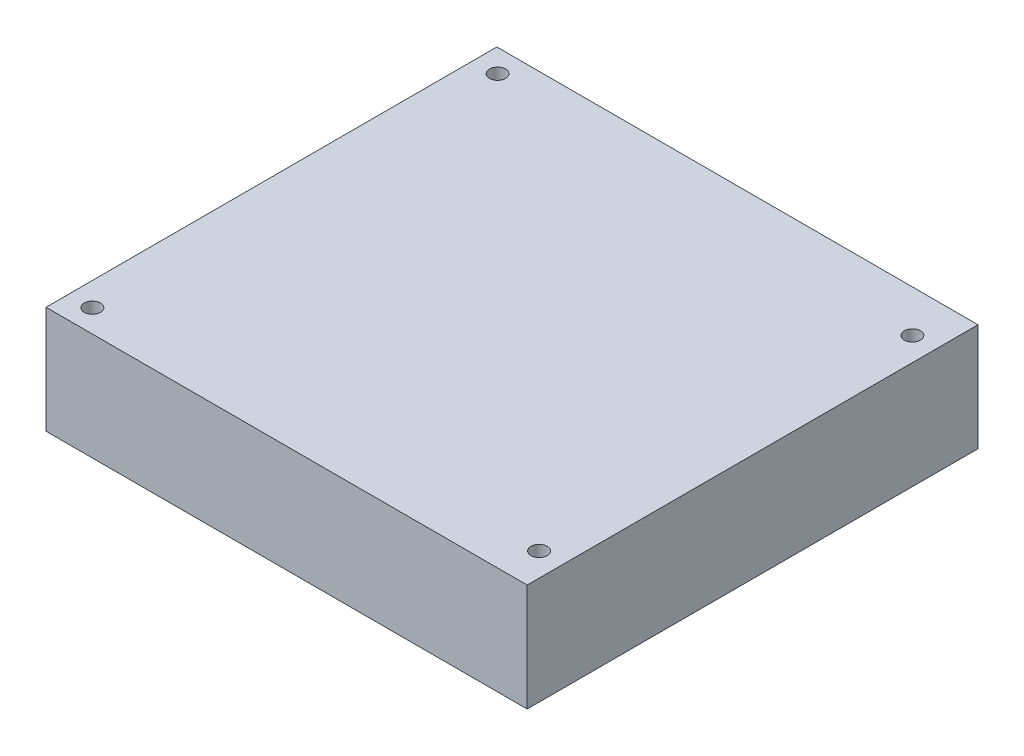
ISO-10303-21;
HEADER;
FILE_DESCRIPTION(('STEP AP214'),'2;1');
FILE_NAME('part.step','',(''),(''),'','','');
FILE_SCHEMA(('AUTOMOTIVE_DESIGN { 1 0 10303 214 1 1 1 1 }'));
ENDSEC;
DATA;
#1=APPLICATION_CONTEXT('core data for automotive mechanical design processes');
#2=APPLICATION_PROTOCOL_DEFINITION('international standard','automotive_design',2000,#1);
#3=PRODUCT_CONTEXT('',#1,'mechanical');
#4=PRODUCT('Part','Part','',(#3));
#5=PRODUCT_RELATED_PRODUCT_CATEGORY('part','',(#4));
#6=PRODUCT_DEFINITION_FORMATION('','',#4);
#7=PRODUCT_DEFINITION_CONTEXT('part definition',#1,'design');
#8=PRODUCT_DEFINITION('design','',#6,#7);
#9=PRODUCT_DEFINITION_SHAPE('','',#8);
#10=(LENGTH_UNIT() NAMED_UNIT(*) SI_UNIT(.MILLI.,.METRE.));
#11=(NAMED_UNIT(*) PLANE_ANGLE_UNIT() SI_UNIT($,.RADIAN.));
#12=(NAMED_UNIT(*) SI_UNIT($,.STERADIAN.) SOLID_ANGLE_UNIT());
#13=UNCERTAINTY_MEASURE_WITH_UNIT(LENGTH_MEASURE(1.E-05),#10,'distance_accuracy_value','');
#14=(GEOMETRIC_REPRESENTATION_CONTEXT(3) GLOBAL_UNCERTAINTY_ASSIGNED_CONTEXT((#13)) GLOBAL_UNIT_ASSIGNED_CONTEXT((#10,
#11,#12)) REPRESENTATION_CONTEXT('',''));
#15=CARTESIAN_POINT('',(0.,0.,0.));
#16=DIRECTION('',(0.,0.,1.));
#17=DIRECTION('',(1.,0.,0.));
#18=AXIS2_PLACEMENT_3D('',#15,#16,#17);
#19=CARTESIAN_POINT('',(0.,21.2,0.));
#20=DIRECTION('',(0.,-1.,0.));
#21=DIRECTION('',(0.,0.,-1.));
#22=AXIS2_PLACEMENT_3D('',#19,#20,#21);
#23=PLANE('',#22);
#24=DIRECTION('',(0.,0.,-1.));
#25=VECTOR('',#24,1.);
#26=CARTESIAN_POINT('',(47.5,21.2,44.505));
#27=LINE('',#26,#25);
#28=CARTESIAN_POINT('',(47.5,21.2,44.505));
#29=VERTEX_POINT('',#28);
#30=CARTESIAN_POINT('',(47.5,21.2,-44.505));
#31=VERTEX_POINT('',#30);
#32=EDGE_CURVE('E91',#29,#31,#27,.T.);
#33=ORIENTED_EDGE('',*,*,#32,.T.);
#34=DIRECTION('',(-1.,0.,0.));
#35=VECTOR('',#34,1.);
#36=CARTESIAN_POINT('',(-47.5,21.2,-44.505));
#37=LINE('',#36,#35);
#38=CARTESIAN_POINT('',(-47.5,21.2,-44.505));
#39=VERTEX_POINT('',#38);
#40=EDGE_CURVE('E86',#31,#39,#37,.T.);
#41=ORIENTED_EDGE('',*,*,#40,.T.);
#42=DIRECTION('',(0.,0.,1.));
#43=VECTOR('',#42,1.);
#44=CARTESIAN_POINT('',(-47.5,21.2,44.505));
#45=LINE('',#44,#43);
#46=CARTESIAN_POINT('',(-47.5,21.2,44.505));
#47=VERTEX_POINT('',#46);
#48=EDGE_CURVE('E89',#39,#47,#45,.T.);
#49=ORIENTED_EDGE('',*,*,#48,.T.);
#50=DIRECTION('',(1.,0.,0.));
#51=VECTOR('',#50,1.);
#52=CARTESIAN_POINT('',(-47.5,21.2,44.505));
#53=LINE('',#52,#51);
#54=EDGE_CURVE('E56',#47,#29,#53,.T.);
#55=ORIENTED_EDGE('',*,*,#54,.T.);
#56=EDGE_LOOP('',(#33,#41,#49,#55));
#57=FACE_BOUND('',#56,.T.);
#58=CARTESIAN_POINT('',(-42.85,21.2,-40.));
#59=DIRECTION('',(0.,1.,0.));
#60=DIRECTION('',(0.,0.,1.));
#61=AXIS2_PLACEMENT_3D('',#58,#59,#60);
#62=CIRCLE('',#61,1.6);
#63=CARTESIAN_POINT('',(-42.85,21.2,-38.4));
#64=VERTEX_POINT('',#63);
#65=EDGE_CURVE('E106',#64,#64,#62,.T.);
#66=ORIENTED_EDGE('',*,*,#65,.F.);
#67=EDGE_LOOP('',(#66));
#68=FACE_BOUND('',#67,.T.);
#69=CARTESIAN_POINT('',(42.85,21.2,-36.2));
#70=DIRECTION('',(0.,1.,0.));
#71=DIRECTION('',(0.,0.,1.));
#72=AXIS2_PLACEMENT_3D('',#69,#70,#71);
#73=CIRCLE('',#72,1.6);
#74=CARTESIAN_POINT('',(42.85,21.2,-34.6));
#75=VERTEX_POINT('',#74);
#76=EDGE_CURVE('E121',#75,#75,#73,.T.);
#77=ORIENTED_EDGE('',*,*,#76,.F.);
#78=EDGE_LOOP('',(#77));
#79=FACE_BOUND('',#78,.T.);
#80=CARTESIAN_POINT('',(-42.85,21.2,40.));
#81=DIRECTION('',(0.,1.,0.));
#82=DIRECTION('',(0.,0.,1.));
#83=AXIS2_PLACEMENT_3D('',#80,#81,#82);
#84=CIRCLE('',#83,1.6);
#85=CARTESIAN_POINT('',(-42.85,21.2,41.6));
#86=VERTEX_POINT('',#85);
#87=EDGE_CURVE('E127',#86,#86,#84,.T.);
#88=ORIENTED_EDGE('',*,*,#87,.F.);
#89=EDGE_LOOP('',(#88));
#90=FACE_BOUND('',#89,.T.);
#91=CARTESIAN_POINT('',(42.85,21.2,37.5));
#92=DIRECTION('',(0.,1.,0.));
#93=DIRECTION('',(0.,0.,1.));
#94=AXIS2_PLACEMENT_3D('',#91,#92,#93);
#95=CIRCLE('',#94,1.6);
#96=CARTESIAN_POINT('',(42.85,21.2,39.1));
#97=VERTEX_POINT('',#96);
#98=EDGE_CURVE('E133',#97,#97,#95,.T.);
#99=ORIENTED_EDGE('',*,*,#98,.F.);
#100=EDGE_LOOP('',(#99));
#101=FACE_BOUND('',#100,.T.);
#102=ADVANCED_FACE('F39',(#57,#68,#79,#90,#101),#23,.F.);
#103=CARTESIAN_POINT('',(0.,0.,0.));
#104=DIRECTION('',(0.,-1.,0.));
#105=DIRECTION('',(0.,0.,-1.));
#106=AXIS2_PLACEMENT_3D('',#103,#104,#105);
#107=PLANE('',#106);
#108=CARTESIAN_POINT('',(-42.85,0.,40.));
#109=DIRECTION('',(0.,1.,0.));
#110=DIRECTION('',(0.,0.,1.));
#111=AXIS2_PLACEMENT_3D('',#108,#109,#110);
#112=CIRCLE('',#111,1.6);
#113=CARTESIAN_POINT('',(-42.85,0.,41.6));
#114=VERTEX_POINT('',#113);
#115=EDGE_CURVE('E130',#114,#114,#112,.T.);
#116=ORIENTED_EDGE('',*,*,#115,.T.);
#117=EDGE_LOOP('',(#116));
#118=FACE_BOUND('',#117,.T.);
#119=CARTESIAN_POINT('',(-42.85,0.,-40.));
#120=DIRECTION('',(0.,1.,0.));
#121=DIRECTION('',(0.,0.,1.));
#122=AXIS2_PLACEMENT_3D('',#119,#120,#121);
#123=CIRCLE('',#122,1.6);
#124=CARTESIAN_POINT('',(-42.85,0.,-38.4));
#125=VERTEX_POINT('',#124);
#126=EDGE_CURVE('E118',#125,#125,#123,.T.);
#127=ORIENTED_EDGE('',*,*,#126,.T.);
#128=EDGE_LOOP('',(#127));
#129=FACE_BOUND('',#128,.T.);
#130=DIRECTION('',(0.,0.,-1.));
#131=VECTOR('',#130,1.);
#132=CARTESIAN_POINT('',(47.5,0.,44.505));
#133=LINE('',#132,#131);
#134=CARTESIAN_POINT('',(47.5,0.,44.505));
#135=VERTEX_POINT('',#134);
#136=CARTESIAN_POINT('',(47.5,0.,-44.505));
#137=VERTEX_POINT('',#136);
#138=EDGE_CURVE('E103',#135,#137,#133,.T.);
#139=ORIENTED_EDGE('',*,*,#138,.F.);
#140=DIRECTION('',(1.,0.,0.));
#141=VECTOR('',#140,1.);
#142=CARTESIAN_POINT('',(-47.5,0.,44.505));
#143=LINE('',#142,#141);
#144=CARTESIAN_POINT('',(-47.5,0.,44.505));
#145=VERTEX_POINT('',#144);
#146=EDGE_CURVE('E79',#145,#135,#143,.T.);
#147=ORIENTED_EDGE('',*,*,#146,.F.);
#148=DIRECTION('',(0.,0.,1.));
#149=VECTOR('',#148,1.);
#150=CARTESIAN_POINT('',(-47.5,0.,44.505));
#151=LINE('',#150,#149);
#152=CARTESIAN_POINT('',(-47.5,0.,-44.505));
#153=VERTEX_POINT('',#152);
#154=EDGE_CURVE('E73',#153,#145,#151,.T.);
#155=ORIENTED_EDGE('',*,*,#154,.F.);
#156=DIRECTION('',(-1.,0.,0.));
#157=VECTOR('',#156,1.);
#158=CARTESIAN_POINT('',(-47.5,0.,-44.505));
#159=LINE('',#158,#157);
#160=EDGE_CURVE('E95',#137,#153,#159,.T.);
#161=ORIENTED_EDGE('',*,*,#160,.F.);
#162=EDGE_LOOP('',(#139,#147,#155,#161));
#163=FACE_BOUND('',#162,.T.);
#164=CARTESIAN_POINT('',(42.85,0.,-36.2));
#165=DIRECTION('',(0.,1.,0.));
#166=DIRECTION('',(0.,0.,1.));
#167=AXIS2_PLACEMENT_3D('',#164,#165,#166);
#168=CIRCLE('',#167,1.6);
#169=CARTESIAN_POINT('',(42.85,0.,-34.6));
#170=VERTEX_POINT('',#169);
#171=EDGE_CURVE('E124',#170,#170,#168,.T.);
#172=ORIENTED_EDGE('',*,*,#171,.T.);
#173=EDGE_LOOP('',(#172));
#174=FACE_BOUND('',#173,.T.);
#175=CARTESIAN_POINT('',(42.85,0.,37.5));
#176=DIRECTION('',(0.,1.,0.));
#177=DIRECTION('',(0.,0.,1.));
#178=AXIS2_PLACEMENT_3D('',#175,#176,#177);
#179=CIRCLE('',#178,1.6);
#180=CARTESIAN_POINT('',(42.85,0.,39.1));
#181=VERTEX_POINT('',#180);
#182=EDGE_CURVE('E136',#181,#181,#179,.T.);
#183=ORIENTED_EDGE('',*,*,#182,.T.);
#184=EDGE_LOOP('',(#183));
#185=FACE_BOUND('',#184,.T.);
#186=ADVANCED_FACE('F114',(#118,#129,#163,#174,#185),#107,.T.);
#187=CARTESIAN_POINT('',(47.5,21.2,44.505));
#188=DIRECTION('',(-1.,0.,0.));
#189=DIRECTION('',(0.,0.,1.));
#190=AXIS2_PLACEMENT_3D('',#187,#188,#189);
#191=PLANE('',#190);
#192=ORIENTED_EDGE('',*,*,#138,.T.);
#193=DIRECTION('',(0.,-1.,0.));
#194=VECTOR('',#193,1.);
#195=CARTESIAN_POINT('',(47.5,21.2,-44.505));
#196=LINE('',#195,#194);
#197=EDGE_CURVE('E11',#31,#137,#196,.T.);
#198=ORIENTED_EDGE('',*,*,#197,.F.);
#199=ORIENTED_EDGE('',*,*,#32,.F.);
#200=DIRECTION('',(0.,-1.,0.));
#201=VECTOR('',#200,1.);
#202=CARTESIAN_POINT('',(47.5,21.2,44.505));
#203=LINE('',#202,#201);
#204=EDGE_CURVE('E99',#29,#135,#203,.T.);
#205=ORIENTED_EDGE('',*,*,#204,.T.);
#206=EDGE_LOOP('',(#192,#198,#199,#205));
#207=FACE_BOUND('',#206,.T.);
#208=ADVANCED_FACE('F41',(#207),#191,.F.);
#209=CARTESIAN_POINT('',(-47.5,21.2,-44.505));
#210=DIRECTION('',(0.,0.,1.));
#211=DIRECTION('',(1.,0.,0.));
#212=AXIS2_PLACEMENT_3D('',#209,#210,#211);
#213=PLANE('',#212);
#214=ORIENTED_EDGE('',*,*,#160,.T.);
#215=DIRECTION('',(0.,-1.,0.));
#216=VECTOR('',#215,1.);
#217=CARTESIAN_POINT('',(-47.5,21.2,-44.505));
#218=LINE('',#217,#216);
#219=EDGE_CURVE('E48',#39,#153,#218,.T.);
#220=ORIENTED_EDGE('',*,*,#219,.F.);
#221=ORIENTED_EDGE('',*,*,#40,.F.);
#222=ORIENTED_EDGE('',*,*,#197,.T.);
#223=EDGE_LOOP('',(#214,#220,#221,#222));
#224=FACE_BOUND('',#223,.T.);
#225=ADVANCED_FACE('F94',(#224),#213,.F.);
#226=CARTESIAN_POINT('',(-47.5,21.2,44.505));
#227=DIRECTION('',(1.,0.,0.));
#228=DIRECTION('',(0.,0.,-1.));
#229=AXIS2_PLACEMENT_3D('',#226,#227,#228);
#230=PLANE('',#229);
#231=ORIENTED_EDGE('',*,*,#154,.T.);
#232=DIRECTION('',(0.,-1.,0.));
#233=VECTOR('',#232,1.);
#234=CARTESIAN_POINT('',(-47.5,21.2,44.505));
#235=LINE('',#234,#233);
#236=EDGE_CURVE('E96',#47,#145,#235,.T.);
#237=ORIENTED_EDGE('',*,*,#236,.F.);
#238=ORIENTED_EDGE('',*,*,#48,.F.);
#239=ORIENTED_EDGE('',*,*,#219,.T.);
#240=EDGE_LOOP('',(#231,#237,#238,#239));
#241=FACE_BOUND('',#240,.T.);
#242=ADVANCED_FACE('F97',(#241),#230,.F.);
#243=CARTESIAN_POINT('',(-47.5,21.2,44.505));
#244=DIRECTION('',(0.,0.,-1.));
#245=DIRECTION('',(-1.,0.,0.));
#246=AXIS2_PLACEMENT_3D('',#243,#244,#245);
#247=PLANE('',#246);
#248=ORIENTED_EDGE('',*,*,#146,.T.);
#249=ORIENTED_EDGE('',*,*,#204,.F.);
#250=ORIENTED_EDGE('',*,*,#54,.F.);
#251=ORIENTED_EDGE('',*,*,#236,.T.);
#252=EDGE_LOOP('',(#248,#249,#250,#251));
#253=FACE_BOUND('',#252,.T.);
#254=ADVANCED_FACE('F111',(#253),#247,.F.);
#255=CARTESIAN_POINT('',(-42.85,21.2,-40.));
#256=DIRECTION('',(0.,-1.,0.));
#257=DIRECTION('',(0.,0.,-1.));
#258=AXIS2_PLACEMENT_3D('',#255,#256,#257);
#259=CYLINDRICAL_SURFACE('',#258,1.6);
#260=ORIENTED_EDGE('',*,*,#65,.T.);
#261=EDGE_LOOP('',(#260));
#262=FACE_BOUND('',#261,.T.);
#263=ORIENTED_EDGE('',*,*,#126,.F.);
#264=EDGE_LOOP('',(#263));
#265=FACE_BOUND('',#264,.T.);
#266=ADVANCED_FACE('F153',(#262,#265),#259,.F.);
#267=CARTESIAN_POINT('',(42.85,21.2,-36.2));
#268=DIRECTION('',(0.,-1.,0.));
#269=DIRECTION('',(0.,0.,-1.));
#270=AXIS2_PLACEMENT_3D('',#267,#268,#269);
#271=CYLINDRICAL_SURFACE('',#270,1.6);
#272=ORIENTED_EDGE('',*,*,#76,.T.);
#273=EDGE_LOOP('',(#272));
#274=FACE_BOUND('',#273,.T.);
#275=ORIENTED_EDGE('',*,*,#171,.F.);
#276=EDGE_LOOP('',(#275));
#277=FACE_BOUND('',#276,.T.);
#278=ADVANCED_FACE('F201',(#274,#277),#271,.F.);
#279=CARTESIAN_POINT('',(-42.85,21.2,40.));
#280=DIRECTION('',(0.,-1.,0.));
#281=DIRECTION('',(0.,0.,-1.));
#282=AXIS2_PLACEMENT_3D('',#279,#280,#281);
#283=CYLINDRICAL_SURFACE('',#282,1.6);
#284=ORIENTED_EDGE('',*,*,#87,.T.);
#285=EDGE_LOOP('',(#284));
#286=FACE_BOUND('',#285,.T.);
#287=ORIENTED_EDGE('',*,*,#115,.F.);
#288=EDGE_LOOP('',(#287));
#289=FACE_BOUND('',#288,.T.);
#290=ADVANCED_FACE('F209',(#286,#289),#283,.F.);
#291=CARTESIAN_POINT('',(42.85,21.2,37.5));
#292=DIRECTION('',(0.,-1.,0.));
#293=DIRECTION('',(0.,0.,-1.));
#294=AXIS2_PLACEMENT_3D('',#291,#292,#293);
#295=CYLINDRICAL_SURFACE('',#294,1.6);
#296=ORIENTED_EDGE('',*,*,#98,.T.);
#297=EDGE_LOOP('',(#296));
#298=FACE_BOUND('',#297,.T.);
#299=ORIENTED_EDGE('',*,*,#182,.F.);
#300=EDGE_LOOP('',(#299));
#301=FACE_BOUND('',#300,.T.);
#302=ADVANCED_FACE('F142',(#298,#301),#295,.F.);
#303=CLOSED_SHELL('',(#102,#186,#208,#225,#242,#254,#266,#278,#290,#302));
#304=MANIFOLD_SOLID_BREP('B2',#303);
#305=ADVANCED_BREP_SHAPE_REPRESENTATION('',(#18,#304),#14);
#306=SHAPE_DEFINITION_REPRESENTATION(#9,#305);
ENDSEC;
END-ISO-10303-21;
